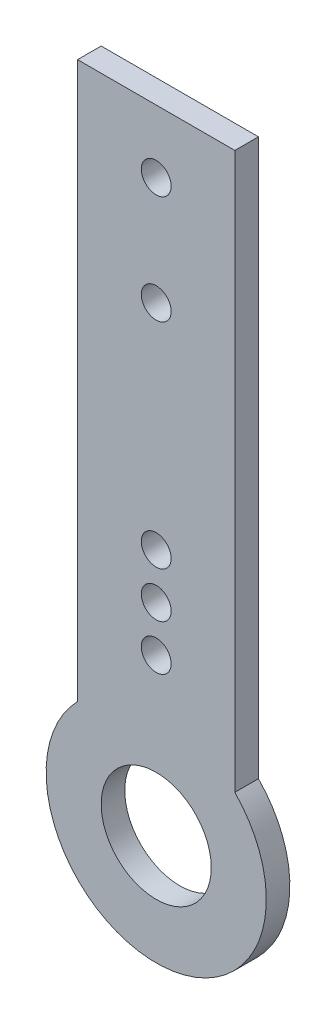
ISO-10303-21;
HEADER;
FILE_DESCRIPTION(('STEP AP214'),'2;1');
FILE_NAME('part.step','',(''),(''),'','','');
FILE_SCHEMA(('AUTOMOTIVE_DESIGN { 1 0 10303 214 1 1 1 1 }'));
ENDSEC;
DATA;
#1=APPLICATION_CONTEXT('core data for automotive mechanical design processes');
#2=APPLICATION_PROTOCOL_DEFINITION('international standard','automotive_design',2000,#1);
#3=PRODUCT_CONTEXT('',#1,'mechanical');
#4=PRODUCT('Part','Part','',(#3));
#5=PRODUCT_RELATED_PRODUCT_CATEGORY('part','',(#4));
#6=PRODUCT_DEFINITION_FORMATION('','',#4);
#7=PRODUCT_DEFINITION_CONTEXT('part definition',#1,'design');
#8=PRODUCT_DEFINITION('design','',#6,#7);
#9=PRODUCT_DEFINITION_SHAPE('','',#8);
#10=(LENGTH_UNIT() NAMED_UNIT(*) SI_UNIT(.MILLI.,.METRE.));
#11=(NAMED_UNIT(*) PLANE_ANGLE_UNIT() SI_UNIT($,.RADIAN.));
#12=(NAMED_UNIT(*) SI_UNIT($,.STERADIAN.) SOLID_ANGLE_UNIT());
#13=UNCERTAINTY_MEASURE_WITH_UNIT(LENGTH_MEASURE(1.E-05),#10,'distance_accuracy_value','');
#14=(GEOMETRIC_REPRESENTATION_CONTEXT(3) GLOBAL_UNCERTAINTY_ASSIGNED_CONTEXT((#13)) GLOBAL_UNIT_ASSIGNED_CONTEXT((#10,
#11,#12)) REPRESENTATION_CONTEXT('',''));
#15=CARTESIAN_POINT('',(0.,0.,0.));
#16=DIRECTION('',(0.,0.,1.));
#17=DIRECTION('',(1.,0.,0.));
#18=AXIS2_PLACEMENT_3D('',#15,#16,#17);
#19=CARTESIAN_POINT('',(0.,0.,1.5));
#20=DIRECTION('',(0.,0.,-1.));
#21=DIRECTION('',(-1.,0.,0.));
#22=AXIS2_PLACEMENT_3D('',#19,#20,#21);
#23=CYLINDRICAL_SURFACE('',#22,7.);
#24=CARTESIAN_POINT('',(0.,0.,0.));
#25=DIRECTION('',(0.,0.,1.));
#26=DIRECTION('',(1.,0.,0.));
#27=AXIS2_PLACEMENT_3D('',#24,#25,#26);
#28=CIRCLE('',#27,7.);
#29=CARTESIAN_POINT('',(-5.,4.89897948556635,0.));
#30=VERTEX_POINT('',#29);
#31=CARTESIAN_POINT('',(5.,4.89897948556635,0.));
#32=VERTEX_POINT('',#31);
#33=EDGE_CURVE('E117',#30,#32,#28,.T.);
#34=ORIENTED_EDGE('',*,*,#33,.T.);
#35=DIRECTION('',(0.,0.,-1.));
#36=VECTOR('',#35,1.);
#37=CARTESIAN_POINT('',(5.,4.89897948556635,1.5));
#38=LINE('',#37,#36);
#39=CARTESIAN_POINT('',(5.,4.89897948556635,1.5));
#40=VERTEX_POINT('',#39);
#41=EDGE_CURVE('E11',#40,#32,#38,.T.);
#42=ORIENTED_EDGE('',*,*,#41,.F.);
#43=CARTESIAN_POINT('',(0.,0.,1.5));
#44=DIRECTION('',(0.,0.,1.));
#45=DIRECTION('',(1.,0.,0.));
#46=AXIS2_PLACEMENT_3D('',#43,#44,#45);
#47=CIRCLE('',#46,7.);
#48=CARTESIAN_POINT('',(-5.,4.89897948556635,1.5));
#49=VERTEX_POINT('',#48);
#50=EDGE_CURVE('E85',#49,#40,#47,.T.);
#51=ORIENTED_EDGE('',*,*,#50,.F.);
#52=DIRECTION('',(0.,0.,-1.));
#53=VECTOR('',#52,1.);
#54=CARTESIAN_POINT('',(-5.,4.89897948556635,1.5));
#55=LINE('',#54,#53);
#56=EDGE_CURVE('E51',#49,#30,#55,.T.);
#57=ORIENTED_EDGE('',*,*,#56,.T.);
#58=EDGE_LOOP('',(#34,#42,#51,#57));
#59=FACE_BOUND('',#58,.T.);
#60=ADVANCED_FACE('F35',(#59),#23,.T.);
#61=CARTESIAN_POINT('',(5.,0.,1.5));
#62=DIRECTION('',(-1.,0.,0.));
#63=DIRECTION('',(0.,-1.,0.));
#64=AXIS2_PLACEMENT_3D('',#61,#62,#63);
#65=PLANE('',#64);
#66=DIRECTION('',(0.,1.,0.));
#67=VECTOR('',#66,1.);
#68=CARTESIAN_POINT('',(5.,0.,0.));
#69=LINE('',#68,#67);
#70=CARTESIAN_POINT('',(5.,40.25,0.));
#71=VERTEX_POINT('',#70);
#72=EDGE_CURVE('E90',#32,#71,#69,.T.);
#73=ORIENTED_EDGE('',*,*,#72,.T.);
#74=DIRECTION('',(0.,0.,-1.));
#75=VECTOR('',#74,1.);
#76=CARTESIAN_POINT('',(5.,40.25,1.5));
#77=LINE('',#76,#75);
#78=CARTESIAN_POINT('',(5.,40.25,1.5));
#79=VERTEX_POINT('',#78);
#80=EDGE_CURVE('E43',#79,#71,#77,.T.);
#81=ORIENTED_EDGE('',*,*,#80,.F.);
#82=DIRECTION('',(0.,1.,0.));
#83=VECTOR('',#82,1.);
#84=CARTESIAN_POINT('',(5.,0.,1.5));
#85=LINE('',#84,#83);
#86=EDGE_CURVE('E76',#40,#79,#85,.T.);
#87=ORIENTED_EDGE('',*,*,#86,.F.);
#88=ORIENTED_EDGE('',*,*,#41,.T.);
#89=EDGE_LOOP('',(#73,#81,#87,#88));
#90=FACE_BOUND('',#89,.T.);
#91=ADVANCED_FACE('F89',(#90),#65,.F.);
#92=CARTESIAN_POINT('',(0.,40.25,1.5));
#93=DIRECTION('',(0.,1.,0.));
#94=DIRECTION('',(0.,0.,1.));
#95=AXIS2_PLACEMENT_3D('',#92,#93,#94);
#96=PLANE('',#95);
#97=DIRECTION('',(1.,0.,0.));
#98=VECTOR('',#97,1.);
#99=CARTESIAN_POINT('',(0.,40.25,0.));
#100=LINE('',#99,#98);
#101=CARTESIAN_POINT('',(-5.,40.25,0.));
#102=VERTEX_POINT('',#101);
#103=EDGE_CURVE('E120',#102,#71,#100,.T.);
#104=ORIENTED_EDGE('',*,*,#103,.F.);
#105=DIRECTION('',(0.,0.,-1.));
#106=VECTOR('',#105,1.);
#107=CARTESIAN_POINT('',(-5.,40.25,1.5));
#108=LINE('',#107,#106);
#109=CARTESIAN_POINT('',(-5.,40.25,1.5));
#110=VERTEX_POINT('',#109);
#111=EDGE_CURVE('E65',#110,#102,#108,.T.);
#112=ORIENTED_EDGE('',*,*,#111,.F.);
#113=DIRECTION('',(1.,0.,0.));
#114=VECTOR('',#113,1.);
#115=CARTESIAN_POINT('',(0.,40.25,1.5));
#116=LINE('',#115,#114);
#117=EDGE_CURVE('E84',#110,#79,#116,.T.);
#118=ORIENTED_EDGE('',*,*,#117,.T.);
#119=ORIENTED_EDGE('',*,*,#80,.T.);
#120=EDGE_LOOP('',(#104,#112,#118,#119));
#121=FACE_BOUND('',#120,.T.);
#122=ADVANCED_FACE('F93',(#121),#96,.T.);
#123=CARTESIAN_POINT('',(0.,15.75,1.5));
#124=DIRECTION('',(0.,0.,-1.));
#125=DIRECTION('',(-1.,0.,0.));
#126=AXIS2_PLACEMENT_3D('',#123,#124,#125);
#127=CYLINDRICAL_SURFACE('',#126,0.949999999999999);
#128=CARTESIAN_POINT('',(0.,15.75,1.5));
#129=DIRECTION('',(0.,0.,1.));
#130=DIRECTION('',(1.,0.,0.));
#131=AXIS2_PLACEMENT_3D('',#128,#129,#130);
#132=CIRCLE('',#131,0.949999999999999);
#133=CARTESIAN_POINT('',(0.949999999999999,15.75,1.5));
#134=VERTEX_POINT('',#133);
#135=EDGE_CURVE('E111',#134,#134,#132,.T.);
#136=ORIENTED_EDGE('',*,*,#135,.T.);
#137=EDGE_LOOP('',(#136));
#138=FACE_BOUND('',#137,.T.);
#139=CARTESIAN_POINT('',(0.,15.75,0.));
#140=DIRECTION('',(0.,0.,1.));
#141=DIRECTION('',(1.,0.,0.));
#142=AXIS2_PLACEMENT_3D('',#139,#140,#141);
#143=CIRCLE('',#142,0.949999999999999);
#144=CARTESIAN_POINT('',(0.949999999999999,15.75,0.));
#145=VERTEX_POINT('',#144);
#146=EDGE_CURVE('E137',#145,#145,#143,.T.);
#147=ORIENTED_EDGE('',*,*,#146,.F.);
#148=EDGE_LOOP('',(#147));
#149=FACE_BOUND('',#148,.T.);
#150=ADVANCED_FACE('F179',(#138,#149),#127,.F.);
#151=CARTESIAN_POINT('',(0.,9.95,1.5));
#152=DIRECTION('',(0.,0.,-1.));
#153=DIRECTION('',(-1.,0.,0.));
#154=AXIS2_PLACEMENT_3D('',#151,#152,#153);
#155=CYLINDRICAL_SURFACE('',#154,0.95);
#156=CARTESIAN_POINT('',(0.,9.95,1.5));
#157=DIRECTION('',(0.,0.,1.));
#158=DIRECTION('',(1.,0.,0.));
#159=AXIS2_PLACEMENT_3D('',#156,#157,#158);
#160=CIRCLE('',#159,0.95);
#161=CARTESIAN_POINT('',(0.95,9.95,1.5));
#162=VERTEX_POINT('',#161);
#163=EDGE_CURVE('E108',#162,#162,#160,.T.);
#164=ORIENTED_EDGE('',*,*,#163,.T.);
#165=EDGE_LOOP('',(#164));
#166=FACE_BOUND('',#165,.T.);
#167=CARTESIAN_POINT('',(0.,9.95,0.));
#168=DIRECTION('',(0.,0.,1.));
#169=DIRECTION('',(1.,0.,0.));
#170=AXIS2_PLACEMENT_3D('',#167,#168,#169);
#171=CIRCLE('',#170,0.95);
#172=CARTESIAN_POINT('',(0.95,9.95,0.));
#173=VERTEX_POINT('',#172);
#174=EDGE_CURVE('E134',#173,#173,#171,.T.);
#175=ORIENTED_EDGE('',*,*,#174,.F.);
#176=EDGE_LOOP('',(#175));
#177=FACE_BOUND('',#176,.T.);
#178=ADVANCED_FACE('F181',(#166,#177),#155,.F.);
#179=CARTESIAN_POINT('',(0.,36.25,1.5));
#180=DIRECTION('',(0.,0.,-1.));
#181=DIRECTION('',(-1.,0.,0.));
#182=AXIS2_PLACEMENT_3D('',#179,#180,#181);
#183=CYLINDRICAL_SURFACE('',#182,0.95);
#184=CARTESIAN_POINT('',(0.,36.25,1.5));
#185=DIRECTION('',(0.,0.,1.));
#186=DIRECTION('',(1.,0.,0.));
#187=AXIS2_PLACEMENT_3D('',#184,#185,#186);
#188=CIRCLE('',#187,0.95);
#189=CARTESIAN_POINT('',(0.95,36.25,1.5));
#190=VERTEX_POINT('',#189);
#191=EDGE_CURVE('E105',#190,#190,#188,.T.);
#192=ORIENTED_EDGE('',*,*,#191,.T.);
#193=EDGE_LOOP('',(#192));
#194=FACE_BOUND('',#193,.T.);
#195=CARTESIAN_POINT('',(0.,36.25,0.));
#196=DIRECTION('',(0.,0.,1.));
#197=DIRECTION('',(1.,0.,0.));
#198=AXIS2_PLACEMENT_3D('',#195,#196,#197);
#199=CIRCLE('',#198,0.95);
#200=CARTESIAN_POINT('',(0.95,36.25,0.));
#201=VERTEX_POINT('',#200);
#202=EDGE_CURVE('E131',#201,#201,#199,.T.);
#203=ORIENTED_EDGE('',*,*,#202,.F.);
#204=EDGE_LOOP('',(#203));
#205=FACE_BOUND('',#204,.T.);
#206=ADVANCED_FACE('F187',(#194,#205),#183,.F.);
#207=CARTESIAN_POINT('',(0.,29.35,1.5));
#208=DIRECTION('',(0.,0.,-1.));
#209=DIRECTION('',(-1.,0.,0.));
#210=AXIS2_PLACEMENT_3D('',#207,#208,#209);
#211=CYLINDRICAL_SURFACE('',#210,0.95);
#212=CARTESIAN_POINT('',(0.,29.35,1.5));
#213=DIRECTION('',(0.,0.,1.));
#214=DIRECTION('',(1.,0.,0.));
#215=AXIS2_PLACEMENT_3D('',#212,#213,#214);
#216=CIRCLE('',#215,0.95);
#217=CARTESIAN_POINT('',(0.95,29.35,1.5));
#218=VERTEX_POINT('',#217);
#219=EDGE_CURVE('E102',#218,#218,#216,.T.);
#220=ORIENTED_EDGE('',*,*,#219,.T.);
#221=EDGE_LOOP('',(#220));
#222=FACE_BOUND('',#221,.T.);
#223=CARTESIAN_POINT('',(0.,29.35,0.));
#224=DIRECTION('',(0.,0.,1.));
#225=DIRECTION('',(1.,0.,0.));
#226=AXIS2_PLACEMENT_3D('',#223,#224,#225);
#227=CIRCLE('',#226,0.95);
#228=CARTESIAN_POINT('',(0.95,29.35,0.));
#229=VERTEX_POINT('',#228);
#230=EDGE_CURVE('E128',#229,#229,#227,.T.);
#231=ORIENTED_EDGE('',*,*,#230,.F.);
#232=EDGE_LOOP('',(#231));
#233=FACE_BOUND('',#232,.T.);
#234=ADVANCED_FACE('F194',(#222,#233),#211,.F.);
#235=CARTESIAN_POINT('',(0.,0.,1.5));
#236=DIRECTION('',(0.,0.,-1.));
#237=DIRECTION('',(-1.,0.,0.));
#238=AXIS2_PLACEMENT_3D('',#235,#236,#237);
#239=CYLINDRICAL_SURFACE('',#238,3.5);
#240=CARTESIAN_POINT('',(0.,0.,1.5));
#241=DIRECTION('',(0.,0.,1.));
#242=DIRECTION('',(1.,0.,0.));
#243=AXIS2_PLACEMENT_3D('',#240,#241,#242);
#244=CIRCLE('',#243,3.5);
#245=CARTESIAN_POINT('',(3.5,0.,1.5));
#246=VERTEX_POINT('',#245);
#247=EDGE_CURVE('E96',#246,#246,#244,.T.);
#248=ORIENTED_EDGE('',*,*,#247,.T.);
#249=EDGE_LOOP('',(#248));
#250=FACE_BOUND('',#249,.T.);
#251=CARTESIAN_POINT('',(0.,0.,0.));
#252=DIRECTION('',(0.,0.,1.));
#253=DIRECTION('',(1.,0.,0.));
#254=AXIS2_PLACEMENT_3D('',#251,#252,#253);
#255=CIRCLE('',#254,3.5);
#256=CARTESIAN_POINT('',(3.5,0.,0.));
#257=VERTEX_POINT('',#256);
#258=EDGE_CURVE('E125',#257,#257,#255,.T.);
#259=ORIENTED_EDGE('',*,*,#258,.F.);
#260=EDGE_LOOP('',(#259));
#261=FACE_BOUND('',#260,.T.);
#262=ADVANCED_FACE('F158',(#250,#261),#239,.F.);
#263=CARTESIAN_POINT('',(-5.,0.,1.5));
#264=DIRECTION('',(-1.,0.,0.));
#265=DIRECTION('',(0.,-1.,0.));
#266=AXIS2_PLACEMENT_3D('',#263,#264,#265);
#267=PLANE('',#266);
#268=DIRECTION('',(0.,1.,0.));
#269=VECTOR('',#268,1.);
#270=CARTESIAN_POINT('',(-5.,0.,0.));
#271=LINE('',#270,#269);
#272=EDGE_CURVE('E122',#30,#102,#271,.T.);
#273=ORIENTED_EDGE('',*,*,#272,.F.);
#274=ORIENTED_EDGE('',*,*,#56,.F.);
#275=DIRECTION('',(0.,1.,0.));
#276=VECTOR('',#275,1.);
#277=CARTESIAN_POINT('',(-5.,0.,1.5));
#278=LINE('',#277,#276);
#279=EDGE_CURVE('E94',#49,#110,#278,.T.);
#280=ORIENTED_EDGE('',*,*,#279,.T.);
#281=ORIENTED_EDGE('',*,*,#111,.T.);
#282=EDGE_LOOP('',(#273,#274,#280,#281));
#283=FACE_BOUND('',#282,.T.);
#284=ADVANCED_FACE('F150',(#283),#267,.T.);
#285=CARTESIAN_POINT('',(0.,12.85,1.5));
#286=DIRECTION('',(0.,0.,-1.));
#287=DIRECTION('',(-1.,0.,0.));
#288=AXIS2_PLACEMENT_3D('',#285,#286,#287);
#289=CYLINDRICAL_SURFACE('',#288,0.95);
#290=CARTESIAN_POINT('',(0.,12.85,1.5));
#291=DIRECTION('',(0.,0.,1.));
#292=DIRECTION('',(1.,0.,0.));
#293=AXIS2_PLACEMENT_3D('',#290,#291,#292);
#294=CIRCLE('',#293,0.95);
#295=CARTESIAN_POINT('',(0.95,12.85,1.5));
#296=VERTEX_POINT('',#295);
#297=EDGE_CURVE('E114',#296,#296,#294,.T.);
#298=ORIENTED_EDGE('',*,*,#297,.T.);
#299=EDGE_LOOP('',(#298));
#300=FACE_BOUND('',#299,.T.);
#301=CARTESIAN_POINT('',(0.,12.85,0.));
#302=DIRECTION('',(0.,0.,1.));
#303=DIRECTION('',(1.,0.,0.));
#304=AXIS2_PLACEMENT_3D('',#301,#302,#303);
#305=CIRCLE('',#304,0.95);
#306=CARTESIAN_POINT('',(0.95,12.85,0.));
#307=VERTEX_POINT('',#306);
#308=EDGE_CURVE('E140',#307,#307,#305,.T.);
#309=ORIENTED_EDGE('',*,*,#308,.F.);
#310=EDGE_LOOP('',(#309));
#311=FACE_BOUND('',#310,.T.);
#312=ADVANCED_FACE('F148',(#300,#311),#289,.F.);
#313=CARTESIAN_POINT('',(0.,0.,1.5));
#314=DIRECTION('',(0.,0.,1.));
#315=DIRECTION('',(1.,0.,0.));
#316=AXIS2_PLACEMENT_3D('',#313,#314,#315);
#317=PLANE('',#316);
#318=ORIENTED_EDGE('',*,*,#50,.T.);
#319=ORIENTED_EDGE('',*,*,#86,.T.);
#320=ORIENTED_EDGE('',*,*,#117,.F.);
#321=ORIENTED_EDGE('',*,*,#279,.F.);
#322=EDGE_LOOP('',(#318,#319,#320,#321));
#323=FACE_BOUND('',#322,.T.);
#324=ORIENTED_EDGE('',*,*,#247,.F.);
#325=EDGE_LOOP('',(#324));
#326=FACE_BOUND('',#325,.T.);
#327=ORIENTED_EDGE('',*,*,#219,.F.);
#328=EDGE_LOOP('',(#327));
#329=FACE_BOUND('',#328,.T.);
#330=ORIENTED_EDGE('',*,*,#191,.F.);
#331=EDGE_LOOP('',(#330));
#332=FACE_BOUND('',#331,.T.);
#333=ORIENTED_EDGE('',*,*,#163,.F.);
#334=EDGE_LOOP('',(#333));
#335=FACE_BOUND('',#334,.T.);
#336=ORIENTED_EDGE('',*,*,#135,.F.);
#337=EDGE_LOOP('',(#336));
#338=FACE_BOUND('',#337,.T.);
#339=ORIENTED_EDGE('',*,*,#297,.F.);
#340=EDGE_LOOP('',(#339));
#341=FACE_BOUND('',#340,.T.);
#342=ADVANCED_FACE('F80',(#323,#326,#329,#332,#335,#338,#341),#317,.T.);
#343=CARTESIAN_POINT('',(0.,0.,0.));
#344=DIRECTION('',(0.,0.,1.));
#345=DIRECTION('',(1.,0.,0.));
#346=AXIS2_PLACEMENT_3D('',#343,#344,#345);
#347=PLANE('',#346);
#348=ORIENTED_EDGE('',*,*,#33,.F.);
#349=ORIENTED_EDGE('',*,*,#272,.T.);
#350=ORIENTED_EDGE('',*,*,#103,.T.);
#351=ORIENTED_EDGE('',*,*,#72,.F.);
#352=EDGE_LOOP('',(#348,#349,#350,#351));
#353=FACE_BOUND('',#352,.T.);
#354=ORIENTED_EDGE('',*,*,#258,.T.);
#355=EDGE_LOOP('',(#354));
#356=FACE_BOUND('',#355,.T.);
#357=ORIENTED_EDGE('',*,*,#230,.T.);
#358=EDGE_LOOP('',(#357));
#359=FACE_BOUND('',#358,.T.);
#360=ORIENTED_EDGE('',*,*,#202,.T.);
#361=EDGE_LOOP('',(#360));
#362=FACE_BOUND('',#361,.T.);
#363=ORIENTED_EDGE('',*,*,#174,.T.);
#364=EDGE_LOOP('',(#363));
#365=FACE_BOUND('',#364,.T.);
#366=ORIENTED_EDGE('',*,*,#146,.T.);
#367=EDGE_LOOP('',(#366));
#368=FACE_BOUND('',#367,.T.);
#369=ORIENTED_EDGE('',*,*,#308,.T.);
#370=EDGE_LOOP('',(#369));
#371=FACE_BOUND('',#370,.T.);
#372=ADVANCED_FACE('F146',(#353,#356,#359,#362,#365,#368,#371),#347,.F.);
#373=CLOSED_SHELL('',(#60,#91,#122,#150,#178,#206,#234,#262,#284,#312,#342,#372));
#374=MANIFOLD_SOLID_BREP('B2',#373);
#375=ADVANCED_BREP_SHAPE_REPRESENTATION('',(#18,#374),#14);
#376=SHAPE_DEFINITION_REPRESENTATION(#9,#375);
ENDSEC;
END-ISO-10303-21;
